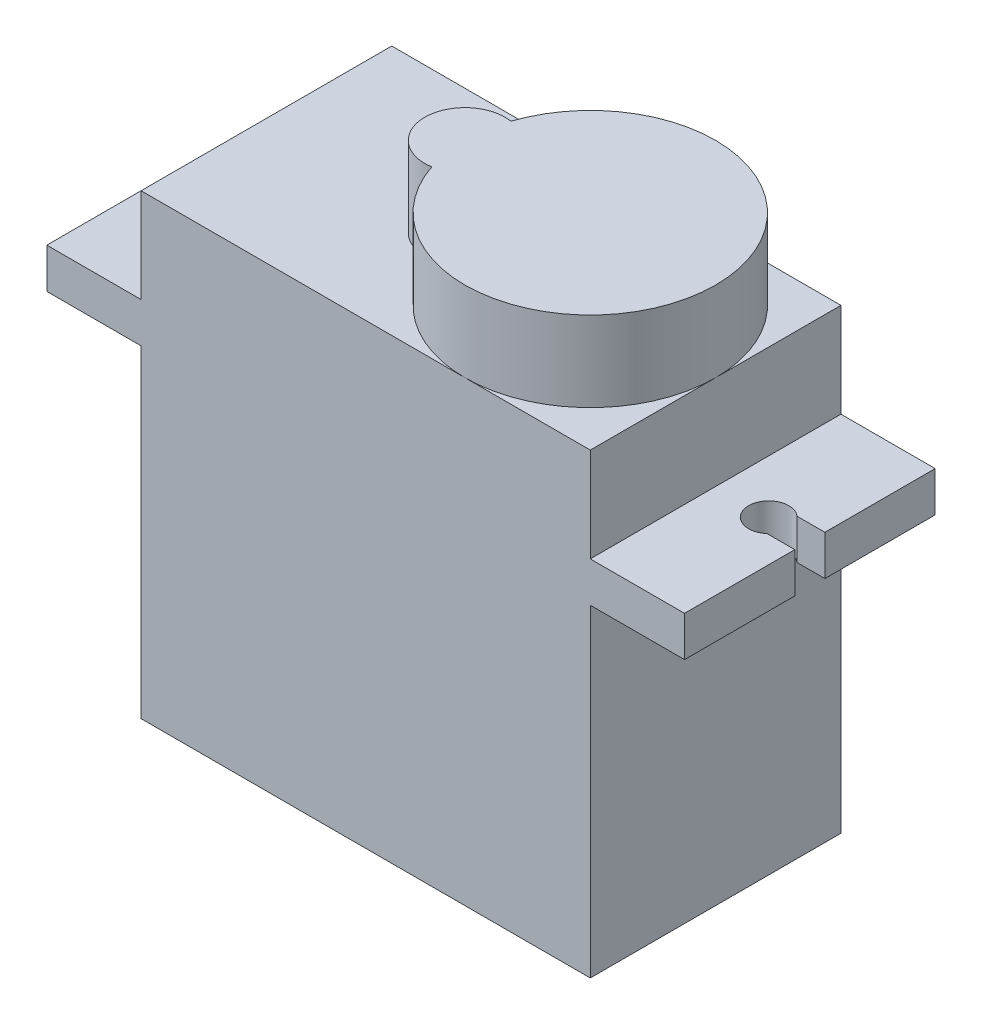
ISO-10303-21;
HEADER;
FILE_DESCRIPTION(('STEP AP214'),'2;1');
FILE_NAME('part.step','',(''),(''),'','','');
FILE_SCHEMA(('AUTOMOTIVE_DESIGN { 1 0 10303 214 1 1 1 1 }'));
ENDSEC;
DATA;
#1=APPLICATION_CONTEXT('core data for automotive mechanical design processes');
#2=APPLICATION_PROTOCOL_DEFINITION('international standard','automotive_design',2000,#1);
#3=PRODUCT_CONTEXT('',#1,'mechanical');
#4=PRODUCT('Part','Part','',(#3));
#5=PRODUCT_RELATED_PRODUCT_CATEGORY('part','',(#4));
#6=PRODUCT_DEFINITION_FORMATION('','',#4);
#7=PRODUCT_DEFINITION_CONTEXT('part definition',#1,'design');
#8=PRODUCT_DEFINITION('design','',#6,#7);
#9=PRODUCT_DEFINITION_SHAPE('','',#8);
#10=(LENGTH_UNIT() NAMED_UNIT(*) SI_UNIT(.MILLI.,.METRE.));
#11=(NAMED_UNIT(*) PLANE_ANGLE_UNIT() SI_UNIT($,.RADIAN.));
#12=(NAMED_UNIT(*) SI_UNIT($,.STERADIAN.) SOLID_ANGLE_UNIT());
#13=UNCERTAINTY_MEASURE_WITH_UNIT(LENGTH_MEASURE(1.E-05),#10,'distance_accuracy_value','');
#14=(GEOMETRIC_REPRESENTATION_CONTEXT(3) GLOBAL_UNCERTAINTY_ASSIGNED_CONTEXT((#13)) GLOBAL_UNIT_ASSIGNED_CONTEXT((#10,
#11,#12)) REPRESENTATION_CONTEXT('',''));
#15=CARTESIAN_POINT('',(0.,0.,0.));
#16=DIRECTION('',(0.,0.,1.));
#17=DIRECTION('',(1.,0.,0.));
#18=AXIS2_PLACEMENT_3D('',#15,#16,#17);
#19=CARTESIAN_POINT('',(-11.2,11.4,12.5));
#20=DIRECTION('',(0.,-1.,0.));
#21=DIRECTION('',(0.,0.,-1.));
#22=AXIS2_PLACEMENT_3D('',#19,#20,#21);
#23=PLANE('',#22);
#24=CARTESIAN_POINT('',(-1.30000000000001,11.4,6.25));
#25=DIRECTION('',(0.,1.,0.));
#26=DIRECTION('',(0.,0.,1.));
#27=AXIS2_PLACEMENT_3D('',#24,#25,#26);
#28=CIRCLE('',#27,2.);
#29=CARTESIAN_POINT('',(-0.98000000000001,11.4,4.2757659713195));
#30=VERTEX_POINT('',#29);
#31=CARTESIAN_POINT('',(-0.980000000000012,11.4,8.22423402868049));
#32=VERTEX_POINT('',#31);
#33=EDGE_CURVE('E209',#30,#32,#28,.T.);
#34=ORIENTED_EDGE('',*,*,#33,.F.);
#35=CARTESIAN_POINT('',(4.94999999999999,11.4,6.25));
#36=DIRECTION('',(0.,1.,0.));
#37=DIRECTION('',(0.,0.,1.));
#38=AXIS2_PLACEMENT_3D('',#35,#36,#37);
#39=CIRCLE('',#38,6.25);
#40=CARTESIAN_POINT('',(4.94999999999999,11.4,0.));
#41=VERTEX_POINT('',#40);
#42=EDGE_CURVE('E363',#41,#30,#39,.T.);
#43=ORIENTED_EDGE('',*,*,#42,.F.);
#44=DIRECTION('',(-1.,0.,0.));
#45=VECTOR('',#44,1.);
#46=CARTESIAN_POINT('',(-11.2,11.4,0.));
#47=LINE('',#46,#45);
#48=CARTESIAN_POINT('',(-11.2,11.4,0.));
#49=VERTEX_POINT('',#48);
#50=EDGE_CURVE('E282',#41,#49,#47,.T.);
#51=ORIENTED_EDGE('',*,*,#50,.T.);
#52=DIRECTION('',(0.,0.,-1.));
#53=VECTOR('',#52,1.);
#54=CARTESIAN_POINT('',(-11.2,11.4,12.5));
#55=LINE('',#54,#53);
#56=CARTESIAN_POINT('',(-11.2,11.4,12.5));
#57=VERTEX_POINT('',#56);
#58=EDGE_CURVE('E341',#57,#49,#55,.T.);
#59=ORIENTED_EDGE('',*,*,#58,.F.);
#60=DIRECTION('',(-1.,0.,0.));
#61=VECTOR('',#60,1.);
#62=CARTESIAN_POINT('',(-11.2,11.4,12.5));
#63=LINE('',#62,#61);
#64=CARTESIAN_POINT('',(4.94999999999999,11.4,12.5));
#65=VERTEX_POINT('',#64);
#66=EDGE_CURVE('E254',#65,#57,#63,.T.);
#67=ORIENTED_EDGE('',*,*,#66,.F.);
#68=EDGE_CURVE('E43',#32,#65,#39,.T.);
#69=ORIENTED_EDGE('',*,*,#68,.F.);
#70=EDGE_LOOP('',(#34,#43,#51,#59,#67,#69));
#71=FACE_BOUND('',#70,.T.);
#72=ADVANCED_FACE('F32',(#71),#23,.F.);
#73=CARTESIAN_POINT('',(11.2,11.4,6.25));
#74=VERTEX_POINT('',#73);
#75=EDGE_CURVE('E11',#65,#74,#39,.T.);
#76=ORIENTED_EDGE('',*,*,#75,.F.);
#77=CARTESIAN_POINT('',(11.2,11.4,12.5));
#78=VERTEX_POINT('',#77);
#79=EDGE_CURVE('E256',#78,#65,#63,.T.);
#80=ORIENTED_EDGE('',*,*,#79,.F.);
#81=DIRECTION('',(0.,0.,-1.));
#82=VECTOR('',#81,1.);
#83=CARTESIAN_POINT('',(11.2,11.4,12.5));
#84=LINE('',#83,#82);
#85=EDGE_CURVE('E345',#78,#74,#84,.T.);
#86=ORIENTED_EDGE('',*,*,#85,.T.);
#87=EDGE_LOOP('',(#76,#80,#86));
#88=FACE_BOUND('',#87,.T.);
#89=ADVANCED_FACE('F368',(#88),#23,.F.);
#90=CARTESIAN_POINT('',(11.2,4.7,12.5));
#91=DIRECTION('',(0.,1.,0.));
#92=DIRECTION('',(0.,0.,1.));
#93=AXIS2_PLACEMENT_3D('',#90,#91,#92);
#94=PLANE('',#93);
#95=DIRECTION('',(1.,0.,0.));
#96=VECTOR('',#95,1.);
#97=CARTESIAN_POINT('',(11.2,4.7,5.5));
#98=LINE('',#97,#96);
#99=CARTESIAN_POINT('',(14.5114378277662,4.7,5.50000000000001));
#100=VERTEX_POINT('',#99);
#101=CARTESIAN_POINT('',(15.9,4.7,5.5));
#102=VERTEX_POINT('',#101);
#103=EDGE_CURVE('E226',#100,#102,#98,.T.);
#104=ORIENTED_EDGE('',*,*,#103,.F.);
#105=CARTESIAN_POINT('',(13.85,4.7,6.25));
#106=DIRECTION('',(0.,1.,0.));
#107=DIRECTION('',(0.,0.,1.));
#108=AXIS2_PLACEMENT_3D('',#105,#106,#107);
#109=CIRCLE('',#108,1.);
#110=CARTESIAN_POINT('',(14.5114378277662,4.7,7.));
#111=VERTEX_POINT('',#110);
#112=EDGE_CURVE('E228',#100,#111,#109,.T.);
#113=ORIENTED_EDGE('',*,*,#112,.T.);
#114=DIRECTION('',(1.,0.,0.));
#115=VECTOR('',#114,1.);
#116=CARTESIAN_POINT('',(11.2,4.7,7.));
#117=LINE('',#116,#115);
#118=CARTESIAN_POINT('',(15.9,4.7,7.));
#119=VERTEX_POINT('',#118);
#120=EDGE_CURVE('E219',#111,#119,#117,.T.);
#121=ORIENTED_EDGE('',*,*,#120,.T.);
#122=DIRECTION('',(0.,0.,-1.));
#123=VECTOR('',#122,1.);
#124=CARTESIAN_POINT('',(15.9,4.7,12.5));
#125=LINE('',#124,#123);
#126=CARTESIAN_POINT('',(15.9,4.7,12.5));
#127=VERTEX_POINT('',#126);
#128=EDGE_CURVE('E315',#127,#119,#125,.T.);
#129=ORIENTED_EDGE('',*,*,#128,.F.);
#130=DIRECTION('',(1.,0.,0.));
#131=VECTOR('',#130,1.);
#132=CARTESIAN_POINT('',(11.2,4.7,12.5));
#133=LINE('',#132,#131);
#134=CARTESIAN_POINT('',(11.2,4.7,12.5));
#135=VERTEX_POINT('',#134);
#136=EDGE_CURVE('E273',#135,#127,#133,.T.);
#137=ORIENTED_EDGE('',*,*,#136,.F.);
#138=DIRECTION('',(0.,0.,-1.));
#139=VECTOR('',#138,1.);
#140=CARTESIAN_POINT('',(11.2,4.7,12.5));
#141=LINE('',#140,#139);
#142=CARTESIAN_POINT('',(11.2,4.7,0.));
#143=VERTEX_POINT('',#142);
#144=EDGE_CURVE('E318',#135,#143,#141,.T.);
#145=ORIENTED_EDGE('',*,*,#144,.T.);
#146=DIRECTION('',(1.,0.,0.));
#147=VECTOR('',#146,1.);
#148=CARTESIAN_POINT('',(11.2,4.7,0.));
#149=LINE('',#148,#147);
#150=CARTESIAN_POINT('',(15.9,4.7,0.));
#151=VERTEX_POINT('',#150);
#152=EDGE_CURVE('E301',#143,#151,#149,.T.);
#153=ORIENTED_EDGE('',*,*,#152,.T.);
#154=EDGE_CURVE('E314',#102,#151,#125,.T.);
#155=ORIENTED_EDGE('',*,*,#154,.F.);
#156=EDGE_LOOP('',(#104,#113,#121,#129,#137,#145,#153,#155));
#157=FACE_BOUND('',#156,.T.);
#158=ADVANCED_FACE('F426',(#157),#94,.F.);
#159=CARTESIAN_POINT('',(15.9,4.7,12.5));
#160=DIRECTION('',(-1.,0.,0.));
#161=DIRECTION('',(0.,0.,1.));
#162=AXIS2_PLACEMENT_3D('',#159,#160,#161);
#163=PLANE('',#162);
#164=DIRECTION('',(0.,1.,0.));
#165=VECTOR('',#164,1.);
#166=CARTESIAN_POINT('',(15.9,-1.1,5.5));
#167=LINE('',#166,#165);
#168=CARTESIAN_POINT('',(15.9,6.7,5.5));
#169=VERTEX_POINT('',#168);
#170=EDGE_CURVE('E220',#102,#169,#167,.T.);
#171=ORIENTED_EDGE('',*,*,#170,.F.);
#172=ORIENTED_EDGE('',*,*,#154,.T.);
#173=DIRECTION('',(0.,1.,0.));
#174=VECTOR('',#173,1.);
#175=CARTESIAN_POINT('',(15.9,4.7,0.));
#176=LINE('',#175,#174);
#177=CARTESIAN_POINT('',(15.9,6.7,0.));
#178=VERTEX_POINT('',#177);
#179=EDGE_CURVE('E304',#151,#178,#176,.T.);
#180=ORIENTED_EDGE('',*,*,#179,.T.);
#181=DIRECTION('',(0.,0.,-1.));
#182=VECTOR('',#181,1.);
#183=CARTESIAN_POINT('',(15.9,6.7,12.5));
#184=LINE('',#183,#182);
#185=EDGE_CURVE('E310',#169,#178,#184,.T.);
#186=ORIENTED_EDGE('',*,*,#185,.F.);
#187=EDGE_LOOP('',(#171,#172,#180,#186));
#188=FACE_BOUND('',#187,.T.);
#189=ADVANCED_FACE('F435',(#188),#163,.F.);
#190=CARTESIAN_POINT('',(15.9,6.7,12.5));
#191=DIRECTION('',(0.,-1.,0.));
#192=DIRECTION('',(1.,0.,0.));
#193=AXIS2_PLACEMENT_3D('',#190,#191,#192);
#194=PLANE('',#193);
#195=DIRECTION('',(-1.,0.,0.));
#196=VECTOR('',#195,1.);
#197=CARTESIAN_POINT('',(15.9,6.7,5.5));
#198=LINE('',#197,#196);
#199=CARTESIAN_POINT('',(14.5114378277662,6.7,5.50000000000001));
#200=VERTEX_POINT('',#199);
#201=EDGE_CURVE('E36',#169,#200,#198,.T.);
#202=ORIENTED_EDGE('',*,*,#201,.F.);
#203=ORIENTED_EDGE('',*,*,#185,.T.);
#204=DIRECTION('',(-1.,0.,0.));
#205=VECTOR('',#204,1.);
#206=CARTESIAN_POINT('',(15.9,6.7,0.));
#207=LINE('',#206,#205);
#208=CARTESIAN_POINT('',(11.2,6.7,0.));
#209=VERTEX_POINT('',#208);
#210=EDGE_CURVE('E255',#178,#209,#207,.T.);
#211=ORIENTED_EDGE('',*,*,#210,.T.);
#212=DIRECTION('',(0.,0.,-1.));
#213=VECTOR('',#212,1.);
#214=CARTESIAN_POINT('',(11.2,6.7,12.5));
#215=LINE('',#214,#213);
#216=CARTESIAN_POINT('',(11.2,6.7,12.5));
#217=VERTEX_POINT('',#216);
#218=EDGE_CURVE('E279',#217,#209,#215,.T.);
#219=ORIENTED_EDGE('',*,*,#218,.F.);
#220=DIRECTION('',(-1.,0.,0.));
#221=VECTOR('',#220,1.);
#222=CARTESIAN_POINT('',(15.9,6.7,12.5));
#223=LINE('',#222,#221);
#224=CARTESIAN_POINT('',(15.9,6.7,12.5));
#225=VERTEX_POINT('',#224);
#226=EDGE_CURVE('E277',#225,#217,#223,.T.);
#227=ORIENTED_EDGE('',*,*,#226,.F.);
#228=CARTESIAN_POINT('',(15.9,6.7,7.));
#229=VERTEX_POINT('',#228);
#230=EDGE_CURVE('E311',#225,#229,#184,.T.);
#231=ORIENTED_EDGE('',*,*,#230,.T.);
#232=DIRECTION('',(-1.,0.,0.));
#233=VECTOR('',#232,1.);
#234=CARTESIAN_POINT('',(15.9,6.7,7.));
#235=LINE('',#234,#233);
#236=CARTESIAN_POINT('',(14.5114378277662,6.7,7.));
#237=VERTEX_POINT('',#236);
#238=EDGE_CURVE('E356',#229,#237,#235,.T.);
#239=ORIENTED_EDGE('',*,*,#238,.T.);
#240=CARTESIAN_POINT('',(13.85,6.7,6.25));
#241=DIRECTION('',(0.,-1.,0.));
#242=DIRECTION('',(1.,0.,0.));
#243=AXIS2_PLACEMENT_3D('',#240,#241,#242);
#244=CIRCLE('',#243,1.);
#245=EDGE_CURVE('E358',#237,#200,#244,.T.);
#246=ORIENTED_EDGE('',*,*,#245,.T.);
#247=EDGE_LOOP('',(#202,#203,#211,#219,#227,#231,#239,#246));
#248=FACE_BOUND('',#247,.T.);
#249=ADVANCED_FACE('F429',(#248),#194,.F.);
#250=CARTESIAN_POINT('',(-15.9,6.7,12.5));
#251=DIRECTION('',(0.,-1.,0.));
#252=DIRECTION('',(1.,0.,0.));
#253=AXIS2_PLACEMENT_3D('',#250,#251,#252);
#254=PLANE('',#253);
#255=DIRECTION('',(1.,0.,0.));
#256=VECTOR('',#255,1.);
#257=CARTESIAN_POINT('',(-15.9,6.7,7.));
#258=LINE('',#257,#256);
#259=CARTESIAN_POINT('',(-15.9,6.7,7.));
#260=VERTEX_POINT('',#259);
#261=CARTESIAN_POINT('',(-14.5114378277661,6.7,7.));
#262=VERTEX_POINT('',#261);
#263=EDGE_CURVE('E248',#260,#262,#258,.T.);
#264=ORIENTED_EDGE('',*,*,#263,.F.);
#265=DIRECTION('',(0.,0.,-1.));
#266=VECTOR('',#265,1.);
#267=CARTESIAN_POINT('',(-15.9,6.7,12.5));
#268=LINE('',#267,#266);
#269=CARTESIAN_POINT('',(-15.9,6.7,12.5));
#270=VERTEX_POINT('',#269);
#271=EDGE_CURVE('E335',#270,#260,#268,.T.);
#272=ORIENTED_EDGE('',*,*,#271,.F.);
#273=DIRECTION('',(-1.,0.,0.));
#274=VECTOR('',#273,1.);
#275=CARTESIAN_POINT('',(-15.9,6.7,12.5));
#276=LINE('',#275,#274);
#277=CARTESIAN_POINT('',(-11.2,6.7,12.5));
#278=VERTEX_POINT('',#277);
#279=EDGE_CURVE('E261',#278,#270,#276,.T.);
#280=ORIENTED_EDGE('',*,*,#279,.F.);
#281=DIRECTION('',(0.,0.,-1.));
#282=VECTOR('',#281,1.);
#283=CARTESIAN_POINT('',(-11.2,6.7,12.5));
#284=LINE('',#283,#282);
#285=CARTESIAN_POINT('',(-11.2,6.7,0.));
#286=VERTEX_POINT('',#285);
#287=EDGE_CURVE('E338',#278,#286,#284,.T.);
#288=ORIENTED_EDGE('',*,*,#287,.T.);
#289=DIRECTION('',(-1.,0.,0.));
#290=VECTOR('',#289,1.);
#291=CARTESIAN_POINT('',(-15.9,6.7,0.));
#292=LINE('',#291,#290);
#293=CARTESIAN_POINT('',(-15.9,6.7,0.));
#294=VERTEX_POINT('',#293);
#295=EDGE_CURVE('E287',#286,#294,#292,.T.);
#296=ORIENTED_EDGE('',*,*,#295,.T.);
#297=CARTESIAN_POINT('',(-15.9,6.7,5.5));
#298=VERTEX_POINT('',#297);
#299=EDGE_CURVE('E334',#298,#294,#268,.T.);
#300=ORIENTED_EDGE('',*,*,#299,.F.);
#301=DIRECTION('',(1.,0.,0.));
#302=VECTOR('',#301,1.);
#303=CARTESIAN_POINT('',(-15.9,6.7,5.5));
#304=LINE('',#303,#302);
#305=CARTESIAN_POINT('',(-14.5114378277661,6.7,5.5));
#306=VERTEX_POINT('',#305);
#307=EDGE_CURVE('E245',#298,#306,#304,.T.);
#308=ORIENTED_EDGE('',*,*,#307,.T.);
#309=CARTESIAN_POINT('',(-13.85,6.7,6.25));
#310=DIRECTION('',(0.,-1.,0.));
#311=DIRECTION('',(1.,0.,0.));
#312=AXIS2_PLACEMENT_3D('',#309,#310,#311);
#313=CIRCLE('',#312,1.);
#314=EDGE_CURVE('E234',#306,#262,#313,.T.);
#315=ORIENTED_EDGE('',*,*,#314,.T.);
#316=EDGE_LOOP('',(#264,#272,#280,#288,#296,#300,#308,#315));
#317=FACE_BOUND('',#316,.T.);
#318=ADVANCED_FACE('F396',(#317),#254,.F.);
#319=CARTESIAN_POINT('',(-15.9,4.7,12.5));
#320=DIRECTION('',(1.,0.,0.));
#321=DIRECTION('',(0.,0.,-1.));
#322=AXIS2_PLACEMENT_3D('',#319,#320,#321);
#323=PLANE('',#322);
#324=DIRECTION('',(0.,1.,0.));
#325=VECTOR('',#324,1.);
#326=CARTESIAN_POINT('',(-15.9,-1.1,7.));
#327=LINE('',#326,#325);
#328=CARTESIAN_POINT('',(-15.9,4.7,7.));
#329=VERTEX_POINT('',#328);
#330=EDGE_CURVE('E232',#329,#260,#327,.T.);
#331=ORIENTED_EDGE('',*,*,#330,.F.);
#332=DIRECTION('',(0.,0.,-1.));
#333=VECTOR('',#332,1.);
#334=CARTESIAN_POINT('',(-15.9,4.7,12.5));
#335=LINE('',#334,#333);
#336=CARTESIAN_POINT('',(-15.9,4.7,12.5));
#337=VERTEX_POINT('',#336);
#338=EDGE_CURVE('E331',#337,#329,#335,.T.);
#339=ORIENTED_EDGE('',*,*,#338,.F.);
#340=DIRECTION('',(0.,-1.,0.));
#341=VECTOR('',#340,1.);
#342=CARTESIAN_POINT('',(-15.9,4.7,12.5));
#343=LINE('',#342,#341);
#344=EDGE_CURVE('E263',#270,#337,#343,.T.);
#345=ORIENTED_EDGE('',*,*,#344,.F.);
#346=ORIENTED_EDGE('',*,*,#271,.T.);
#347=EDGE_LOOP('',(#331,#339,#345,#346));
#348=FACE_BOUND('',#347,.T.);
#349=ADVANCED_FACE('F399',(#348),#323,.F.);
#350=CARTESIAN_POINT('',(-11.2,4.7,12.5));
#351=DIRECTION('',(0.,1.,0.));
#352=DIRECTION('',(0.,0.,1.));
#353=AXIS2_PLACEMENT_3D('',#350,#351,#352);
#354=PLANE('',#353);
#355=DIRECTION('',(-1.,0.,0.));
#356=VECTOR('',#355,1.);
#357=CARTESIAN_POINT('',(-11.2,4.7,7.));
#358=LINE('',#357,#356);
#359=CARTESIAN_POINT('',(-14.5114378277661,4.7,7.));
#360=VERTEX_POINT('',#359);
#361=EDGE_CURVE('E354',#360,#329,#358,.T.);
#362=ORIENTED_EDGE('',*,*,#361,.F.);
#363=CARTESIAN_POINT('',(-13.85,4.7,6.25));
#364=DIRECTION('',(0.,1.,0.));
#365=DIRECTION('',(0.,0.,1.));
#366=AXIS2_PLACEMENT_3D('',#363,#364,#365);
#367=CIRCLE('',#366,1.);
#368=CARTESIAN_POINT('',(-14.5114378277661,4.7,5.5));
#369=VERTEX_POINT('',#368);
#370=EDGE_CURVE('E348',#360,#369,#367,.T.);
#371=ORIENTED_EDGE('',*,*,#370,.T.);
#372=DIRECTION('',(-1.,0.,0.));
#373=VECTOR('',#372,1.);
#374=CARTESIAN_POINT('',(-11.2,4.7,5.5));
#375=LINE('',#374,#373);
#376=CARTESIAN_POINT('',(-15.9,4.7,5.5));
#377=VERTEX_POINT('',#376);
#378=EDGE_CURVE('E351',#369,#377,#375,.T.);
#379=ORIENTED_EDGE('',*,*,#378,.T.);
#380=CARTESIAN_POINT('',(-15.9,4.7,0.));
#381=VERTEX_POINT('',#380);
#382=EDGE_CURVE('E330',#377,#381,#335,.T.);
#383=ORIENTED_EDGE('',*,*,#382,.T.);
#384=DIRECTION('',(1.,0.,0.));
#385=VECTOR('',#384,1.);
#386=CARTESIAN_POINT('',(-11.2,4.7,0.));
#387=LINE('',#386,#385);
#388=CARTESIAN_POINT('',(-11.2,4.7,0.));
#389=VERTEX_POINT('',#388);
#390=EDGE_CURVE('E293',#381,#389,#387,.T.);
#391=ORIENTED_EDGE('',*,*,#390,.T.);
#392=DIRECTION('',(0.,0.,-1.));
#393=VECTOR('',#392,1.);
#394=CARTESIAN_POINT('',(-11.2,4.7,12.5));
#395=LINE('',#394,#393);
#396=CARTESIAN_POINT('',(-11.2,4.7,12.5));
#397=VERTEX_POINT('',#396);
#398=EDGE_CURVE('E327',#397,#389,#395,.T.);
#399=ORIENTED_EDGE('',*,*,#398,.F.);
#400=DIRECTION('',(1.,0.,0.));
#401=VECTOR('',#400,1.);
#402=CARTESIAN_POINT('',(-11.2,4.7,12.5));
#403=LINE('',#402,#401);
#404=EDGE_CURVE('E265',#337,#397,#403,.T.);
#405=ORIENTED_EDGE('',*,*,#404,.F.);
#406=ORIENTED_EDGE('',*,*,#338,.T.);
#407=EDGE_LOOP('',(#362,#371,#379,#383,#391,#399,#405,#406));
#408=FACE_BOUND('',#407,.T.);
#409=ADVANCED_FACE('F404',(#408),#354,.F.);
#410=CARTESIAN_POINT('',(11.2,6.7,12.5));
#411=DIRECTION('',(-1.,0.,0.));
#412=DIRECTION('',(0.,-1.,0.));
#413=AXIS2_PLACEMENT_3D('',#410,#411,#412);
#414=PLANE('',#413);
#415=DIRECTION('',(0.,1.,0.));
#416=VECTOR('',#415,1.);
#417=CARTESIAN_POINT('',(11.2,6.7,0.));
#418=LINE('',#417,#416);
#419=CARTESIAN_POINT('',(11.2,11.4,0.));
#420=VERTEX_POINT('',#419);
#421=EDGE_CURVE('E250',#209,#420,#418,.T.);
#422=ORIENTED_EDGE('',*,*,#421,.T.);
#423=EDGE_CURVE('E344',#74,#420,#84,.T.);
#424=ORIENTED_EDGE('',*,*,#423,.F.);
#425=ORIENTED_EDGE('',*,*,#85,.F.);
#426=DIRECTION('',(0.,1.,0.));
#427=VECTOR('',#426,1.);
#428=CARTESIAN_POINT('',(11.2,6.7,12.5));
#429=LINE('',#428,#427);
#430=EDGE_CURVE('E251',#217,#78,#429,.T.);
#431=ORIENTED_EDGE('',*,*,#430,.F.);
#432=ORIENTED_EDGE('',*,*,#218,.T.);
#433=EDGE_LOOP('',(#422,#424,#425,#431,#432));
#434=FACE_BOUND('',#433,.T.);
#435=ADVANCED_FACE('F34',(#434),#414,.F.);
#436=EDGE_CURVE('E41',#74,#41,#39,.T.);
#437=ORIENTED_EDGE('',*,*,#436,.F.);
#438=ORIENTED_EDGE('',*,*,#423,.T.);
#439=EDGE_CURVE('E283',#420,#41,#47,.T.);
#440=ORIENTED_EDGE('',*,*,#439,.T.);
#441=EDGE_LOOP('',(#437,#438,#440));
#442=FACE_BOUND('',#441,.T.);
#443=ADVANCED_FACE('F380',(#442),#23,.F.);
#444=CARTESIAN_POINT('',(-11.2,6.7,12.5));
#445=DIRECTION('',(1.,0.,0.));
#446=DIRECTION('',(0.,0.,-1.));
#447=AXIS2_PLACEMENT_3D('',#444,#445,#446);
#448=PLANE('',#447);
#449=DIRECTION('',(0.,-1.,0.));
#450=VECTOR('',#449,1.);
#451=CARTESIAN_POINT('',(-11.2,6.7,0.));
#452=LINE('',#451,#450);
#453=EDGE_CURVE('E285',#49,#286,#452,.T.);
#454=ORIENTED_EDGE('',*,*,#453,.T.);
#455=ORIENTED_EDGE('',*,*,#287,.F.);
#456=DIRECTION('',(0.,-1.,0.));
#457=VECTOR('',#456,1.);
#458=CARTESIAN_POINT('',(-11.2,6.7,12.5));
#459=LINE('',#458,#457);
#460=EDGE_CURVE('E259',#57,#278,#459,.T.);
#461=ORIENTED_EDGE('',*,*,#460,.F.);
#462=ORIENTED_EDGE('',*,*,#58,.T.);
#463=EDGE_LOOP('',(#454,#455,#461,#462));
#464=FACE_BOUND('',#463,.T.);
#465=ADVANCED_FACE('F388',(#464),#448,.F.);
#466=ORIENTED_EDGE('',*,*,#382,.F.);
#467=DIRECTION('',(0.,1.,0.));
#468=VECTOR('',#467,1.);
#469=CARTESIAN_POINT('',(-15.9,-1.1,5.5));
#470=LINE('',#469,#468);
#471=EDGE_CURVE('E235',#377,#298,#470,.T.);
#472=ORIENTED_EDGE('',*,*,#471,.T.);
#473=ORIENTED_EDGE('',*,*,#299,.T.);
#474=DIRECTION('',(0.,-1.,0.));
#475=VECTOR('',#474,1.);
#476=CARTESIAN_POINT('',(-15.9,4.7,0.));
#477=LINE('',#476,#475);
#478=EDGE_CURVE('E290',#294,#381,#477,.T.);
#479=ORIENTED_EDGE('',*,*,#478,.T.);
#480=EDGE_LOOP('',(#466,#472,#473,#479));
#481=FACE_BOUND('',#480,.T.);
#482=ADVANCED_FACE('F462',(#481),#323,.F.);
#483=CARTESIAN_POINT('',(-11.2,-11.4,12.5));
#484=DIRECTION('',(1.,0.,0.));
#485=DIRECTION('',(0.,0.,-1.));
#486=AXIS2_PLACEMENT_3D('',#483,#484,#485);
#487=PLANE('',#486);
#488=DIRECTION('',(0.,-1.,0.));
#489=VECTOR('',#488,1.);
#490=CARTESIAN_POINT('',(-11.2,-11.4,0.));
#491=LINE('',#490,#489);
#492=CARTESIAN_POINT('',(-11.2,-11.4,0.));
#493=VERTEX_POINT('',#492);
#494=EDGE_CURVE('E295',#389,#493,#491,.T.);
#495=ORIENTED_EDGE('',*,*,#494,.T.);
#496=DIRECTION('',(0.,0.,-1.));
#497=VECTOR('',#496,1.);
#498=CARTESIAN_POINT('',(-11.2,-11.4,12.5));
#499=LINE('',#498,#497);
#500=CARTESIAN_POINT('',(-11.2,-11.4,12.5));
#501=VERTEX_POINT('',#500);
#502=EDGE_CURVE('E324',#501,#493,#499,.T.);
#503=ORIENTED_EDGE('',*,*,#502,.F.);
#504=DIRECTION('',(0.,-1.,0.));
#505=VECTOR('',#504,1.);
#506=CARTESIAN_POINT('',(-11.2,-11.4,12.5));
#507=LINE('',#506,#505);
#508=EDGE_CURVE('E267',#397,#501,#507,.T.);
#509=ORIENTED_EDGE('',*,*,#508,.F.);
#510=ORIENTED_EDGE('',*,*,#398,.T.);
#511=EDGE_LOOP('',(#495,#503,#509,#510));
#512=FACE_BOUND('',#511,.T.);
#513=ADVANCED_FACE('F410',(#512),#487,.F.);
#514=CARTESIAN_POINT('',(-11.2,-11.4,12.5));
#515=DIRECTION('',(0.,1.,0.));
#516=DIRECTION('',(0.,0.,1.));
#517=AXIS2_PLACEMENT_3D('',#514,#515,#516);
#518=PLANE('',#517);
#519=DIRECTION('',(1.,0.,0.));
#520=VECTOR('',#519,1.);
#521=CARTESIAN_POINT('',(-11.2,-11.4,0.));
#522=LINE('',#521,#520);
#523=CARTESIAN_POINT('',(11.2,-11.4,0.));
#524=VERTEX_POINT('',#523);
#525=EDGE_CURVE('E297',#493,#524,#522,.T.);
#526=ORIENTED_EDGE('',*,*,#525,.T.);
#527=DIRECTION('',(0.,0.,-1.));
#528=VECTOR('',#527,1.);
#529=CARTESIAN_POINT('',(11.2,-11.4,12.5));
#530=LINE('',#529,#528);
#531=CARTESIAN_POINT('',(11.2,-11.4,12.5));
#532=VERTEX_POINT('',#531);
#533=EDGE_CURVE('E321',#532,#524,#530,.T.);
#534=ORIENTED_EDGE('',*,*,#533,.F.);
#535=DIRECTION('',(1.,0.,0.));
#536=VECTOR('',#535,1.);
#537=CARTESIAN_POINT('',(-11.2,-11.4,12.5));
#538=LINE('',#537,#536);
#539=EDGE_CURVE('E269',#501,#532,#538,.T.);
#540=ORIENTED_EDGE('',*,*,#539,.F.);
#541=ORIENTED_EDGE('',*,*,#502,.T.);
#542=EDGE_LOOP('',(#526,#534,#540,#541));
#543=FACE_BOUND('',#542,.T.);
#544=ADVANCED_FACE('F414',(#543),#518,.F.);
#545=CARTESIAN_POINT('',(11.2,-11.4,12.5));
#546=DIRECTION('',(-1.,0.,0.));
#547=DIRECTION('',(0.,0.,1.));
#548=AXIS2_PLACEMENT_3D('',#545,#546,#547);
#549=PLANE('',#548);
#550=DIRECTION('',(0.,1.,0.));
#551=VECTOR('',#550,1.);
#552=CARTESIAN_POINT('',(11.2,-11.4,0.));
#553=LINE('',#552,#551);
#554=EDGE_CURVE('E299',#524,#143,#553,.T.);
#555=ORIENTED_EDGE('',*,*,#554,.T.);
#556=ORIENTED_EDGE('',*,*,#144,.F.);
#557=DIRECTION('',(0.,1.,0.));
#558=VECTOR('',#557,1.);
#559=CARTESIAN_POINT('',(11.2,-11.4,12.5));
#560=LINE('',#559,#558);
#561=EDGE_CURVE('E271',#532,#135,#560,.T.);
#562=ORIENTED_EDGE('',*,*,#561,.F.);
#563=ORIENTED_EDGE('',*,*,#533,.T.);
#564=EDGE_LOOP('',(#555,#556,#562,#563));
#565=FACE_BOUND('',#564,.T.);
#566=ADVANCED_FACE('F419',(#565),#549,.F.);
#567=ORIENTED_EDGE('',*,*,#128,.T.);
#568=DIRECTION('',(0.,1.,0.));
#569=VECTOR('',#568,1.);
#570=CARTESIAN_POINT('',(15.9,-1.1,7.));
#571=LINE('',#570,#569);
#572=EDGE_CURVE('E212',#119,#229,#571,.T.);
#573=ORIENTED_EDGE('',*,*,#572,.T.);
#574=ORIENTED_EDGE('',*,*,#230,.F.);
#575=DIRECTION('',(0.,1.,0.));
#576=VECTOR('',#575,1.);
#577=CARTESIAN_POINT('',(15.9,4.7,12.5));
#578=LINE('',#577,#576);
#579=EDGE_CURVE('E275',#127,#225,#578,.T.);
#580=ORIENTED_EDGE('',*,*,#579,.F.);
#581=EDGE_LOOP('',(#567,#573,#574,#580));
#582=FACE_BOUND('',#581,.T.);
#583=ADVANCED_FACE('F428',(#582),#163,.F.);
#584=CARTESIAN_POINT('',(0.,0.,12.5));
#585=DIRECTION('',(0.,0.,-1.));
#586=DIRECTION('',(-1.,0.,0.));
#587=AXIS2_PLACEMENT_3D('',#584,#585,#586);
#588=PLANE('',#587);
#589=ORIENTED_EDGE('',*,*,#430,.T.);
#590=ORIENTED_EDGE('',*,*,#79,.T.);
#591=ORIENTED_EDGE('',*,*,#66,.T.);
#592=ORIENTED_EDGE('',*,*,#460,.T.);
#593=ORIENTED_EDGE('',*,*,#279,.T.);
#594=ORIENTED_EDGE('',*,*,#344,.T.);
#595=ORIENTED_EDGE('',*,*,#404,.T.);
#596=ORIENTED_EDGE('',*,*,#508,.T.);
#597=ORIENTED_EDGE('',*,*,#539,.T.);
#598=ORIENTED_EDGE('',*,*,#561,.T.);
#599=ORIENTED_EDGE('',*,*,#136,.T.);
#600=ORIENTED_EDGE('',*,*,#579,.T.);
#601=ORIENTED_EDGE('',*,*,#226,.T.);
#602=EDGE_LOOP('',(#589,#590,#591,#592,#593,#594,#595,#596,#597,#598,#599,#600,#601));
#603=FACE_BOUND('',#602,.T.);
#604=ADVANCED_FACE('F373',(#603),#588,.F.);
#605=CARTESIAN_POINT('',(0.,0.,0.));
#606=DIRECTION('',(0.,0.,-1.));
#607=DIRECTION('',(-1.,0.,0.));
#608=AXIS2_PLACEMENT_3D('',#605,#606,#607);
#609=PLANE('',#608);
#610=ORIENTED_EDGE('',*,*,#421,.F.);
#611=ORIENTED_EDGE('',*,*,#210,.F.);
#612=ORIENTED_EDGE('',*,*,#179,.F.);
#613=ORIENTED_EDGE('',*,*,#152,.F.);
#614=ORIENTED_EDGE('',*,*,#554,.F.);
#615=ORIENTED_EDGE('',*,*,#525,.F.);
#616=ORIENTED_EDGE('',*,*,#494,.F.);
#617=ORIENTED_EDGE('',*,*,#390,.F.);
#618=ORIENTED_EDGE('',*,*,#478,.F.);
#619=ORIENTED_EDGE('',*,*,#295,.F.);
#620=ORIENTED_EDGE('',*,*,#453,.F.);
#621=ORIENTED_EDGE('',*,*,#50,.F.);
#622=ORIENTED_EDGE('',*,*,#439,.F.);
#623=EDGE_LOOP('',(#610,#611,#612,#613,#614,#615,#616,#617,#618,#619,#620,#621,#622));
#624=FACE_BOUND('',#623,.T.);
#625=ADVANCED_FACE('F383',(#624),#609,.T.);
#626=CARTESIAN_POINT('',(0.,-1.1,7.));
#627=DIRECTION('',(0.,0.,-1.));
#628=DIRECTION('',(-1.,0.,0.));
#629=AXIS2_PLACEMENT_3D('',#626,#627,#628);
#630=PLANE('',#629);
#631=ORIENTED_EDGE('',*,*,#263,.T.);
#632=DIRECTION('',(0.,1.,0.));
#633=VECTOR('',#632,1.);
#634=CARTESIAN_POINT('',(-14.5114378277661,-1.1,7.));
#635=LINE('',#634,#633);
#636=EDGE_CURVE('E231',#360,#262,#635,.T.);
#637=ORIENTED_EDGE('',*,*,#636,.F.);
#638=ORIENTED_EDGE('',*,*,#361,.T.);
#639=ORIENTED_EDGE('',*,*,#330,.T.);
#640=EDGE_LOOP('',(#631,#637,#638,#639));
#641=FACE_BOUND('',#640,.T.);
#642=ADVANCED_FACE('F546',(#641),#630,.T.);
#643=CARTESIAN_POINT('',(0.,-1.1,5.5));
#644=DIRECTION('',(0.,0.,-1.));
#645=DIRECTION('',(-1.,0.,0.));
#646=AXIS2_PLACEMENT_3D('',#643,#644,#645);
#647=PLANE('',#646);
#648=ORIENTED_EDGE('',*,*,#471,.F.);
#649=ORIENTED_EDGE('',*,*,#378,.F.);
#650=DIRECTION('',(0.,1.,0.));
#651=VECTOR('',#650,1.);
#652=CARTESIAN_POINT('',(-14.5114378277661,-1.1,5.5));
#653=LINE('',#652,#651);
#654=EDGE_CURVE('E238',#369,#306,#653,.T.);
#655=ORIENTED_EDGE('',*,*,#654,.T.);
#656=ORIENTED_EDGE('',*,*,#307,.F.);
#657=EDGE_LOOP('',(#648,#649,#655,#656));
#658=FACE_BOUND('',#657,.T.);
#659=ADVANCED_FACE('F579',(#658),#647,.F.);
#660=CARTESIAN_POINT('',(-13.85,-1.1,6.25));
#661=DIRECTION('',(0.,1.,0.));
#662=DIRECTION('',(0.,0.,1.));
#663=AXIS2_PLACEMENT_3D('',#660,#661,#662);
#664=CYLINDRICAL_SURFACE('',#663,1.);
#665=ORIENTED_EDGE('',*,*,#654,.F.);
#666=ORIENTED_EDGE('',*,*,#370,.F.);
#667=ORIENTED_EDGE('',*,*,#636,.T.);
#668=ORIENTED_EDGE('',*,*,#314,.F.);
#669=EDGE_LOOP('',(#665,#666,#667,#668));
#670=FACE_BOUND('',#669,.T.);
#671=ADVANCED_FACE('F588',(#670),#664,.F.);
#672=CARTESIAN_POINT('',(13.85,-1.1,6.25));
#673=DIRECTION('',(0.,1.,0.));
#674=DIRECTION('',(0.,0.,1.));
#675=AXIS2_PLACEMENT_3D('',#672,#673,#674);
#676=CYLINDRICAL_SURFACE('',#675,1.);
#677=DIRECTION('',(0.,1.,0.));
#678=VECTOR('',#677,1.);
#679=CARTESIAN_POINT('',(14.5114378277662,-1.1,5.50000000000001));
#680=LINE('',#679,#678);
#681=EDGE_CURVE('E216',#100,#200,#680,.T.);
#682=ORIENTED_EDGE('',*,*,#681,.T.);
#683=ORIENTED_EDGE('',*,*,#245,.F.);
#684=DIRECTION('',(0.,1.,0.));
#685=VECTOR('',#684,1.);
#686=CARTESIAN_POINT('',(14.5114378277662,-1.1,7.));
#687=LINE('',#686,#685);
#688=EDGE_CURVE('E210',#111,#237,#687,.T.);
#689=ORIENTED_EDGE('',*,*,#688,.F.);
#690=ORIENTED_EDGE('',*,*,#112,.F.);
#691=EDGE_LOOP('',(#682,#683,#689,#690));
#692=FACE_BOUND('',#691,.T.);
#693=ADVANCED_FACE('F439',(#692),#676,.F.);
#694=CARTESIAN_POINT('',(0.,-1.1,5.5));
#695=DIRECTION('',(0.,0.,1.));
#696=DIRECTION('',(1.,0.,0.));
#697=AXIS2_PLACEMENT_3D('',#694,#695,#696);
#698=PLANE('',#697);
#699=ORIENTED_EDGE('',*,*,#103,.T.);
#700=ORIENTED_EDGE('',*,*,#170,.T.);
#701=ORIENTED_EDGE('',*,*,#201,.T.);
#702=ORIENTED_EDGE('',*,*,#681,.F.);
#703=EDGE_LOOP('',(#699,#700,#701,#702));
#704=FACE_BOUND('',#703,.T.);
#705=ADVANCED_FACE('F437',(#704),#698,.T.);
#706=CARTESIAN_POINT('',(0.,-1.1,7.));
#707=DIRECTION('',(0.,0.,1.));
#708=DIRECTION('',(1.,0.,0.));
#709=AXIS2_PLACEMENT_3D('',#706,#707,#708);
#710=PLANE('',#709);
#711=ORIENTED_EDGE('',*,*,#688,.T.);
#712=ORIENTED_EDGE('',*,*,#238,.F.);
#713=ORIENTED_EDGE('',*,*,#572,.F.);
#714=ORIENTED_EDGE('',*,*,#120,.F.);
#715=EDGE_LOOP('',(#711,#712,#713,#714));
#716=FACE_BOUND('',#715,.T.);
#717=ADVANCED_FACE('F442',(#716),#710,.F.);
#718=CARTESIAN_POINT('',(-1.30000000000001,15.4,6.25));
#719=DIRECTION('',(0.,-1.,0.));
#720=DIRECTION('',(0.,0.,-1.));
#721=AXIS2_PLACEMENT_3D('',#718,#719,#720);
#722=CYLINDRICAL_SURFACE('',#721,2.);
#723=ORIENTED_EDGE('',*,*,#33,.T.);
#724=DIRECTION('',(0.,-1.,0.));
#725=VECTOR('',#724,1.);
#726=CARTESIAN_POINT('',(-0.980000000000012,15.4,8.22423402868049));
#727=LINE('',#726,#725);
#728=CARTESIAN_POINT('',(-0.980000000000012,15.4,8.22423402868049));
#729=VERTEX_POINT('',#728);
#730=EDGE_CURVE('E196',#729,#32,#727,.T.);
#731=ORIENTED_EDGE('',*,*,#730,.F.);
#732=CARTESIAN_POINT('',(-1.30000000000001,15.4,6.25));
#733=DIRECTION('',(0.,1.,0.));
#734=DIRECTION('',(0.,0.,1.));
#735=AXIS2_PLACEMENT_3D('',#732,#733,#734);
#736=CIRCLE('',#735,2.);
#737=CARTESIAN_POINT('',(-0.98000000000001,15.4,4.2757659713195));
#738=VERTEX_POINT('',#737);
#739=EDGE_CURVE('E203',#738,#729,#736,.T.);
#740=ORIENTED_EDGE('',*,*,#739,.F.);
#741=DIRECTION('',(0.,-1.,0.));
#742=VECTOR('',#741,1.);
#743=CARTESIAN_POINT('',(-0.98000000000001,15.4,4.2757659713195));
#744=LINE('',#743,#742);
#745=EDGE_CURVE('E200',#738,#30,#744,.T.);
#746=ORIENTED_EDGE('',*,*,#745,.T.);
#747=EDGE_LOOP('',(#723,#731,#740,#746));
#748=FACE_BOUND('',#747,.T.);
#749=ADVANCED_FACE('F208',(#748),#722,.T.);
#750=CARTESIAN_POINT('',(4.94999999999999,15.4,6.25));
#751=DIRECTION('',(0.,-1.,0.));
#752=DIRECTION('',(0.,0.,-1.));
#753=AXIS2_PLACEMENT_3D('',#750,#751,#752);
#754=CYLINDRICAL_SURFACE('',#753,6.25);
#755=ORIENTED_EDGE('',*,*,#68,.T.);
#756=ORIENTED_EDGE('',*,*,#75,.T.);
#757=ORIENTED_EDGE('',*,*,#436,.T.);
#758=ORIENTED_EDGE('',*,*,#42,.T.);
#759=ORIENTED_EDGE('',*,*,#745,.F.);
#760=CARTESIAN_POINT('',(4.94999999999999,15.4,6.25));
#761=DIRECTION('',(0.,1.,0.));
#762=DIRECTION('',(0.,0.,1.));
#763=AXIS2_PLACEMENT_3D('',#760,#761,#762);
#764=CIRCLE('',#763,6.25);
#765=EDGE_CURVE('E192',#729,#738,#764,.T.);
#766=ORIENTED_EDGE('',*,*,#765,.F.);
#767=ORIENTED_EDGE('',*,*,#730,.T.);
#768=EDGE_LOOP('',(#755,#756,#757,#758,#759,#766,#767));
#769=FACE_BOUND('',#768,.T.);
#770=ADVANCED_FACE('F194',(#769),#754,.T.);
#771=CARTESIAN_POINT('',(1.82499999999999,15.4,6.25));
#772=DIRECTION('',(0.,1.,0.));
#773=DIRECTION('',(0.,0.,1.));
#774=AXIS2_PLACEMENT_3D('',#771,#772,#773);
#775=PLANE('',#774);
#776=ORIENTED_EDGE('',*,*,#739,.T.);
#777=ORIENTED_EDGE('',*,*,#765,.T.);
#778=EDGE_LOOP('',(#776,#777));
#779=FACE_BOUND('',#778,.T.);
#780=ADVANCED_FACE('F205',(#779),#775,.T.);
#781=CLOSED_SHELL('',(#72,#89,#158,#189,#249,#318,#349,#409,#435,#443,#465,#482,#513,#544,#566,
#583,#604,#625,#642,#659,#671,#693,#705,#717,#749,#770,#780));
#782=MANIFOLD_SOLID_BREP('B2',#781);
#783=ADVANCED_BREP_SHAPE_REPRESENTATION('',(#18,#782),#14);
#784=SHAPE_DEFINITION_REPRESENTATION(#9,#783);
ENDSEC;
END-ISO-10303-21;
